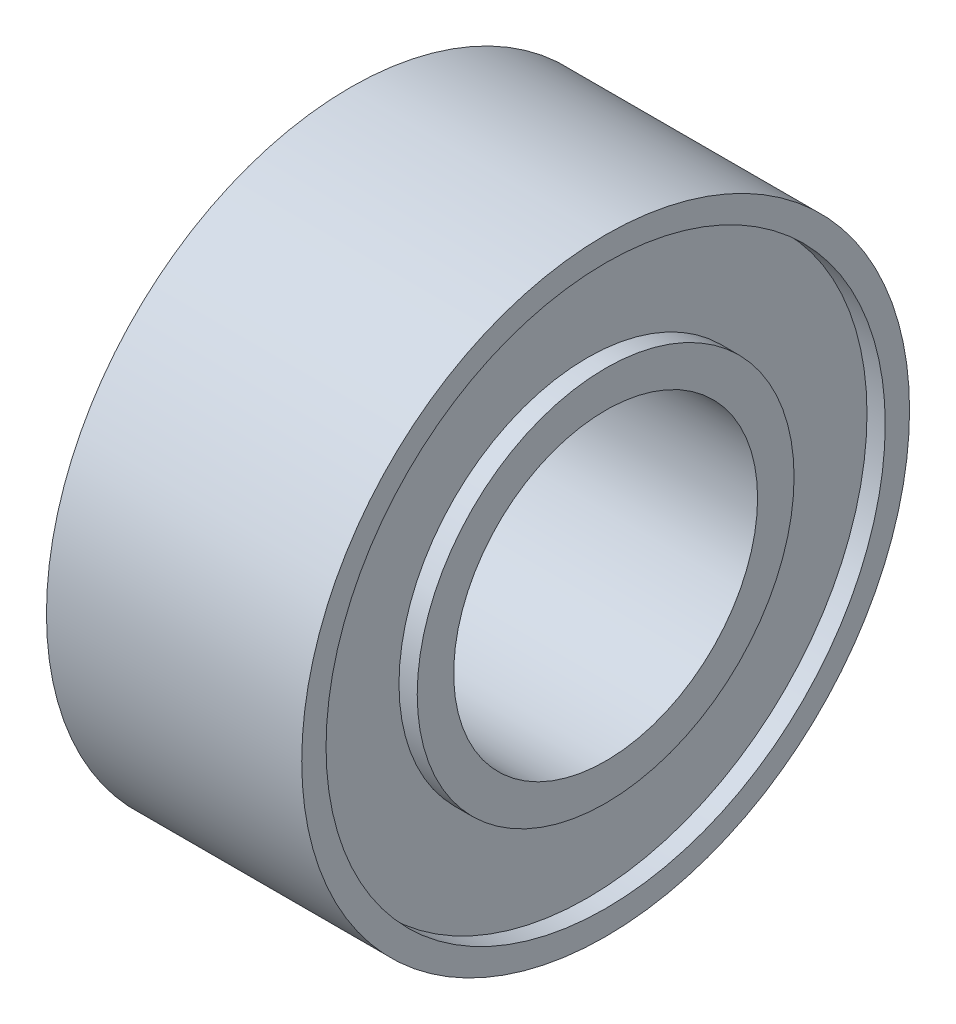
ISO-10303-21;
HEADER;
FILE_DESCRIPTION(('STEP AP214'),'2;1');
FILE_NAME('part.step','',(''),(''),'','','');
FILE_SCHEMA(('AUTOMOTIVE_DESIGN { 1 0 10303 214 1 1 1 1 }'));
ENDSEC;
DATA;
#1=APPLICATION_CONTEXT('core data for automotive mechanical design processes');
#2=APPLICATION_PROTOCOL_DEFINITION('international standard','automotive_design',2000,#1);
#3=PRODUCT_CONTEXT('',#1,'mechanical');
#4=PRODUCT('Part','Part','',(#3));
#5=PRODUCT_RELATED_PRODUCT_CATEGORY('part','',(#4));
#6=PRODUCT_DEFINITION_FORMATION('','',#4);
#7=PRODUCT_DEFINITION_CONTEXT('part definition',#1,'design');
#8=PRODUCT_DEFINITION('design','',#6,#7);
#9=PRODUCT_DEFINITION_SHAPE('','',#8);
#10=(LENGTH_UNIT() NAMED_UNIT(*) SI_UNIT(.MILLI.,.METRE.));
#11=(NAMED_UNIT(*) PLANE_ANGLE_UNIT() SI_UNIT($,.RADIAN.));
#12=(NAMED_UNIT(*) SI_UNIT($,.STERADIAN.) SOLID_ANGLE_UNIT());
#13=UNCERTAINTY_MEASURE_WITH_UNIT(LENGTH_MEASURE(1.E-05),#10,'distance_accuracy_value','');
#14=(GEOMETRIC_REPRESENTATION_CONTEXT(3) GLOBAL_UNCERTAINTY_ASSIGNED_CONTEXT((#13)) GLOBAL_UNIT_ASSIGNED_CONTEXT((#10,
#11,#12)) REPRESENTATION_CONTEXT('',''));
#15=CARTESIAN_POINT('',(0.,0.,0.));
#16=DIRECTION('',(0.,0.,1.));
#17=DIRECTION('',(1.,0.,0.));
#18=AXIS2_PLACEMENT_3D('',#15,#16,#17);
#19=CARTESIAN_POINT('',(-2.1,2.5,0.));
#20=DIRECTION('',(-1.,0.,0.));
#21=DIRECTION('',(0.,0.,1.));
#22=AXIS2_PLACEMENT_3D('',#19,#20,#21);
#23=PLANE('',#22);
#24=CARTESIAN_POINT('',(-2.1,0.,0.));
#25=DIRECTION('',(1.,0.,0.));
#26=DIRECTION('',(0.,0.,-1.));
#27=AXIS2_PLACEMENT_3D('',#24,#25,#26);
#28=CIRCLE('',#27,2.5);
#29=CARTESIAN_POINT('',(-2.1,0.,-2.5));
#30=VERTEX_POINT('',#29);
#31=EDGE_CURVE('E80',#30,#30,#28,.T.);
#32=ORIENTED_EDGE('',*,*,#31,.T.);
#33=EDGE_LOOP('',(#32));
#34=FACE_BOUND('',#33,.T.);
#35=CARTESIAN_POINT('',(-2.1,0.,0.));
#36=DIRECTION('',(1.,0.,0.));
#37=DIRECTION('',(0.,0.,-1.));
#38=AXIS2_PLACEMENT_3D('',#35,#36,#37);
#39=CIRCLE('',#38,3.1);
#40=CARTESIAN_POINT('',(-2.1,0.,-3.1));
#41=VERTEX_POINT('',#40);
#42=EDGE_CURVE('E10',#41,#41,#39,.T.);
#43=ORIENTED_EDGE('',*,*,#42,.F.);
#44=EDGE_LOOP('',(#43));
#45=FACE_BOUND('',#44,.T.);
#46=ADVANCED_FACE('F36',(#34,#45),#23,.T.);
#47=CARTESIAN_POINT('',(0.,0.,0.));
#48=DIRECTION('',(1.,0.,0.));
#49=DIRECTION('',(0.,0.,-1.));
#50=AXIS2_PLACEMENT_3D('',#47,#48,#49);
#51=CYLINDRICAL_SURFACE('',#50,3.1);
#52=ORIENTED_EDGE('',*,*,#42,.T.);
#53=EDGE_LOOP('',(#52));
#54=FACE_BOUND('',#53,.T.);
#55=CARTESIAN_POINT('',(-1.8,0.,0.));
#56=DIRECTION('',(1.,0.,0.));
#57=DIRECTION('',(0.,0.,-1.));
#58=AXIS2_PLACEMENT_3D('',#55,#56,#57);
#59=CIRCLE('',#58,3.1);
#60=CARTESIAN_POINT('',(-1.8,0.,-3.1));
#61=VERTEX_POINT('',#60);
#62=EDGE_CURVE('E42',#61,#61,#59,.T.);
#63=ORIENTED_EDGE('',*,*,#62,.F.);
#64=EDGE_LOOP('',(#63));
#65=FACE_BOUND('',#64,.T.);
#66=ADVANCED_FACE('F100',(#54,#65),#51,.T.);
#67=CARTESIAN_POINT('',(-1.8,3.1,0.));
#68=DIRECTION('',(-1.,0.,0.));
#69=DIRECTION('',(0.,0.,1.));
#70=AXIS2_PLACEMENT_3D('',#67,#68,#69);
#71=PLANE('',#70);
#72=ORIENTED_EDGE('',*,*,#62,.T.);
#73=EDGE_LOOP('',(#72));
#74=FACE_BOUND('',#73,.T.);
#75=CARTESIAN_POINT('',(-1.8,0.,0.));
#76=DIRECTION('',(1.,0.,0.));
#77=DIRECTION('',(0.,0.,-1.));
#78=AXIS2_PLACEMENT_3D('',#75,#76,#77);
#79=CIRCLE('',#78,4.6);
#80=CARTESIAN_POINT('',(-1.8,0.,-4.6));
#81=VERTEX_POINT('',#80);
#82=EDGE_CURVE('E46',#81,#81,#79,.T.);
#83=ORIENTED_EDGE('',*,*,#82,.F.);
#84=EDGE_LOOP('',(#83));
#85=FACE_BOUND('',#84,.T.);
#86=ADVANCED_FACE('F104',(#74,#85),#71,.T.);
#87=CARTESIAN_POINT('',(0.,0.,0.));
#88=DIRECTION('',(1.,0.,0.));
#89=DIRECTION('',(0.,0.,-1.));
#90=AXIS2_PLACEMENT_3D('',#87,#88,#89);
#91=CYLINDRICAL_SURFACE('',#90,4.6);
#92=ORIENTED_EDGE('',*,*,#82,.T.);
#93=EDGE_LOOP('',(#92));
#94=FACE_BOUND('',#93,.T.);
#95=CARTESIAN_POINT('',(-2.1,0.,0.));
#96=DIRECTION('',(1.,0.,0.));
#97=DIRECTION('',(0.,0.,-1.));
#98=AXIS2_PLACEMENT_3D('',#95,#96,#97);
#99=CIRCLE('',#98,4.6);
#100=CARTESIAN_POINT('',(-2.1,0.,-4.6));
#101=VERTEX_POINT('',#100);
#102=EDGE_CURVE('E50',#101,#101,#99,.T.);
#103=ORIENTED_EDGE('',*,*,#102,.F.);
#104=EDGE_LOOP('',(#103));
#105=FACE_BOUND('',#104,.T.);
#106=ADVANCED_FACE('F108',(#94,#105),#91,.F.);
#107=CARTESIAN_POINT('',(-2.1,4.6,0.));
#108=DIRECTION('',(-1.,0.,0.));
#109=DIRECTION('',(0.,0.,1.));
#110=AXIS2_PLACEMENT_3D('',#107,#108,#109);
#111=PLANE('',#110);
#112=ORIENTED_EDGE('',*,*,#102,.T.);
#113=EDGE_LOOP('',(#112));
#114=FACE_BOUND('',#113,.T.);
#115=CARTESIAN_POINT('',(-2.1,0.,0.));
#116=DIRECTION('',(1.,0.,0.));
#117=DIRECTION('',(0.,0.,-1.));
#118=AXIS2_PLACEMENT_3D('',#115,#116,#117);
#119=CIRCLE('',#118,5.);
#120=CARTESIAN_POINT('',(-2.1,0.,-5.));
#121=VERTEX_POINT('',#120);
#122=EDGE_CURVE('E56',#121,#121,#119,.T.);
#123=ORIENTED_EDGE('',*,*,#122,.F.);
#124=EDGE_LOOP('',(#123));
#125=FACE_BOUND('',#124,.T.);
#126=ADVANCED_FACE('F114',(#114,#125),#111,.T.);
#127=CARTESIAN_POINT('',(0.,0.,0.));
#128=DIRECTION('',(1.,0.,0.));
#129=DIRECTION('',(0.,0.,-1.));
#130=AXIS2_PLACEMENT_3D('',#127,#128,#129);
#131=CYLINDRICAL_SURFACE('',#130,5.);
#132=ORIENTED_EDGE('',*,*,#122,.T.);
#133=EDGE_LOOP('',(#132));
#134=FACE_BOUND('',#133,.T.);
#135=CARTESIAN_POINT('',(2.1,0.,0.));
#136=DIRECTION('',(1.,0.,0.));
#137=DIRECTION('',(0.,0.,-1.));
#138=AXIS2_PLACEMENT_3D('',#135,#136,#137);
#139=CIRCLE('',#138,5.);
#140=CARTESIAN_POINT('',(2.1,0.,-5.));
#141=VERTEX_POINT('',#140);
#142=EDGE_CURVE('E60',#141,#141,#139,.T.);
#143=ORIENTED_EDGE('',*,*,#142,.F.);
#144=EDGE_LOOP('',(#143));
#145=FACE_BOUND('',#144,.T.);
#146=ADVANCED_FACE('F118',(#134,#145),#131,.T.);
#147=CARTESIAN_POINT('',(2.1,4.6,0.));
#148=DIRECTION('',(1.,0.,0.));
#149=DIRECTION('',(0.,0.,-1.));
#150=AXIS2_PLACEMENT_3D('',#147,#148,#149);
#151=PLANE('',#150);
#152=ORIENTED_EDGE('',*,*,#142,.T.);
#153=EDGE_LOOP('',(#152));
#154=FACE_BOUND('',#153,.T.);
#155=CARTESIAN_POINT('',(2.1,0.,0.));
#156=DIRECTION('',(1.,0.,0.));
#157=DIRECTION('',(0.,0.,-1.));
#158=AXIS2_PLACEMENT_3D('',#155,#156,#157);
#159=CIRCLE('',#158,4.6);
#160=CARTESIAN_POINT('',(2.1,0.,-4.6));
#161=VERTEX_POINT('',#160);
#162=EDGE_CURVE('E63',#161,#161,#159,.T.);
#163=ORIENTED_EDGE('',*,*,#162,.F.);
#164=EDGE_LOOP('',(#163));
#165=FACE_BOUND('',#164,.T.);
#166=ADVANCED_FACE('F122',(#154,#165),#151,.T.);
#167=CARTESIAN_POINT('',(0.,0.,0.));
#168=DIRECTION('',(1.,0.,0.));
#169=DIRECTION('',(0.,0.,-1.));
#170=AXIS2_PLACEMENT_3D('',#167,#168,#169);
#171=CYLINDRICAL_SURFACE('',#170,4.6);
#172=ORIENTED_EDGE('',*,*,#162,.T.);
#173=EDGE_LOOP('',(#172));
#174=FACE_BOUND('',#173,.T.);
#175=CARTESIAN_POINT('',(1.8,0.,0.));
#176=DIRECTION('',(1.,0.,0.));
#177=DIRECTION('',(0.,0.,-1.));
#178=AXIS2_PLACEMENT_3D('',#175,#176,#177);
#179=CIRCLE('',#178,4.6);
#180=CARTESIAN_POINT('',(1.8,0.,-4.6));
#181=VERTEX_POINT('',#180);
#182=EDGE_CURVE('E67',#181,#181,#179,.T.);
#183=ORIENTED_EDGE('',*,*,#182,.F.);
#184=EDGE_LOOP('',(#183));
#185=FACE_BOUND('',#184,.T.);
#186=ADVANCED_FACE('F126',(#174,#185),#171,.F.);
#187=CARTESIAN_POINT('',(1.8,3.1,0.));
#188=DIRECTION('',(1.,0.,0.));
#189=DIRECTION('',(0.,0.,-1.));
#190=AXIS2_PLACEMENT_3D('',#187,#188,#189);
#191=PLANE('',#190);
#192=ORIENTED_EDGE('',*,*,#182,.T.);
#193=EDGE_LOOP('',(#192));
#194=FACE_BOUND('',#193,.T.);
#195=CARTESIAN_POINT('',(1.8,0.,0.));
#196=DIRECTION('',(1.,0.,0.));
#197=DIRECTION('',(0.,0.,-1.));
#198=AXIS2_PLACEMENT_3D('',#195,#196,#197);
#199=CIRCLE('',#198,3.1);
#200=CARTESIAN_POINT('',(1.8,0.,-3.1));
#201=VERTEX_POINT('',#200);
#202=EDGE_CURVE('E71',#201,#201,#199,.T.);
#203=ORIENTED_EDGE('',*,*,#202,.F.);
#204=EDGE_LOOP('',(#203));
#205=FACE_BOUND('',#204,.T.);
#206=ADVANCED_FACE('F130',(#194,#205),#191,.T.);
#207=CARTESIAN_POINT('',(0.,0.,0.));
#208=DIRECTION('',(1.,0.,0.));
#209=DIRECTION('',(0.,0.,-1.));
#210=AXIS2_PLACEMENT_3D('',#207,#208,#209);
#211=CYLINDRICAL_SURFACE('',#210,3.1);
#212=ORIENTED_EDGE('',*,*,#202,.T.);
#213=EDGE_LOOP('',(#212));
#214=FACE_BOUND('',#213,.T.);
#215=CARTESIAN_POINT('',(2.1,0.,0.));
#216=DIRECTION('',(1.,0.,0.));
#217=DIRECTION('',(0.,0.,-1.));
#218=AXIS2_PLACEMENT_3D('',#215,#216,#217);
#219=CIRCLE('',#218,3.1);
#220=CARTESIAN_POINT('',(2.1,0.,-3.1));
#221=VERTEX_POINT('',#220);
#222=EDGE_CURVE('E74',#221,#221,#219,.T.);
#223=ORIENTED_EDGE('',*,*,#222,.F.);
#224=EDGE_LOOP('',(#223));
#225=FACE_BOUND('',#224,.T.);
#226=ADVANCED_FACE('F96',(#214,#225),#211,.T.);
#227=CARTESIAN_POINT('',(2.1,2.5,0.));
#228=DIRECTION('',(1.,0.,0.));
#229=DIRECTION('',(0.,0.,-1.));
#230=AXIS2_PLACEMENT_3D('',#227,#228,#229);
#231=PLANE('',#230);
#232=ORIENTED_EDGE('',*,*,#222,.T.);
#233=EDGE_LOOP('',(#232));
#234=FACE_BOUND('',#233,.T.);
#235=CARTESIAN_POINT('',(2.1,0.,0.));
#236=DIRECTION('',(1.,0.,0.));
#237=DIRECTION('',(0.,0.,-1.));
#238=AXIS2_PLACEMENT_3D('',#235,#236,#237);
#239=CIRCLE('',#238,2.5);
#240=CARTESIAN_POINT('',(2.1,0.,-2.5));
#241=VERTEX_POINT('',#240);
#242=EDGE_CURVE('E77',#241,#241,#239,.T.);
#243=ORIENTED_EDGE('',*,*,#242,.F.);
#244=EDGE_LOOP('',(#243));
#245=FACE_BOUND('',#244,.T.);
#246=ADVANCED_FACE('F90',(#234,#245),#231,.T.);
#247=CARTESIAN_POINT('',(0.,0.,0.));
#248=DIRECTION('',(1.,0.,0.));
#249=DIRECTION('',(0.,0.,-1.));
#250=AXIS2_PLACEMENT_3D('',#247,#248,#249);
#251=CYLINDRICAL_SURFACE('',#250,2.5);
#252=ORIENTED_EDGE('',*,*,#242,.T.);
#253=EDGE_LOOP('',(#252));
#254=FACE_BOUND('',#253,.T.);
#255=ORIENTED_EDGE('',*,*,#31,.F.);
#256=EDGE_LOOP('',(#255));
#257=FACE_BOUND('',#256,.T.);
#258=ADVANCED_FACE('F88',(#254,#257),#251,.F.);
#259=CLOSED_SHELL('',(#46,#66,#86,#106,#126,#146,#166,#186,#206,#226,#246,#258));
#260=MANIFOLD_SOLID_BREP('B2',#259);
#261=ADVANCED_BREP_SHAPE_REPRESENTATION('',(#18,#260),#14);
#262=SHAPE_DEFINITION_REPRESENTATION(#9,#261);
ENDSEC;
END-ISO-10303-21;
